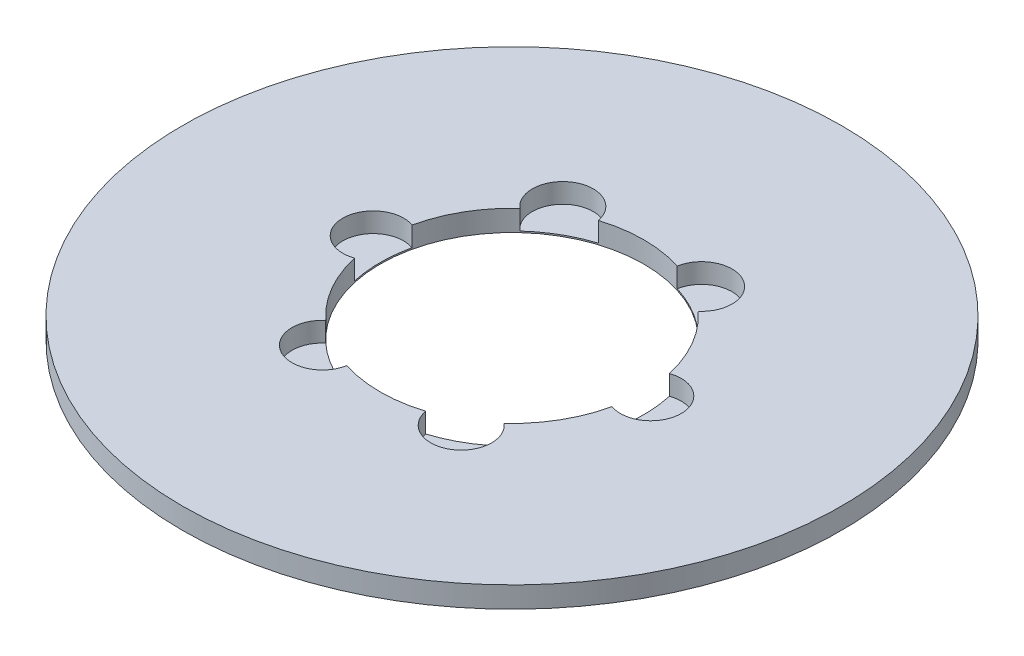
ISO-10303-21;
HEADER;
FILE_DESCRIPTION(('STEP AP214'),'2;1');
FILE_NAME('part.step','',(''),(''),'','','');
FILE_SCHEMA(('AUTOMOTIVE_DESIGN { 1 0 10303 214 1 1 1 1 }'));
ENDSEC;
DATA;
#1=APPLICATION_CONTEXT('core data for automotive mechanical design processes');
#2=APPLICATION_PROTOCOL_DEFINITION('international standard','automotive_design',2000,#1);
#3=PRODUCT_CONTEXT('',#1,'mechanical');
#4=PRODUCT('Part','Part','',(#3));
#5=PRODUCT_RELATED_PRODUCT_CATEGORY('part','',(#4));
#6=PRODUCT_DEFINITION_FORMATION('','',#4);
#7=PRODUCT_DEFINITION_CONTEXT('part definition',#1,'design');
#8=PRODUCT_DEFINITION('design','',#6,#7);
#9=PRODUCT_DEFINITION_SHAPE('','',#8);
#10=(LENGTH_UNIT() NAMED_UNIT(*) SI_UNIT(.MILLI.,.METRE.));
#11=(NAMED_UNIT(*) PLANE_ANGLE_UNIT() SI_UNIT($,.RADIAN.));
#12=(NAMED_UNIT(*) SI_UNIT($,.STERADIAN.) SOLID_ANGLE_UNIT());
#13=UNCERTAINTY_MEASURE_WITH_UNIT(LENGTH_MEASURE(1.E-05),#10,'distance_accuracy_value','');
#14=(GEOMETRIC_REPRESENTATION_CONTEXT(3) GLOBAL_UNCERTAINTY_ASSIGNED_CONTEXT((#13)) GLOBAL_UNIT_ASSIGNED_CONTEXT((#10,
#11,#12)) REPRESENTATION_CONTEXT('',''));
#15=CARTESIAN_POINT('',(0.,0.,0.));
#16=DIRECTION('',(0.,0.,1.));
#17=DIRECTION('',(1.,0.,0.));
#18=AXIS2_PLACEMENT_3D('',#15,#16,#17);
#19=CARTESIAN_POINT('',(0.,4.,0.));
#20=DIRECTION('',(0.,-1.,0.));
#21=DIRECTION('',(0.,0.,-1.));
#22=AXIS2_PLACEMENT_3D('',#19,#20,#21);
#23=CYLINDRICAL_SURFACE('',#22,62.5);
#24=CARTESIAN_POINT('',(0.,4.,0.));
#25=DIRECTION('',(0.,1.,0.));
#26=DIRECTION('',(0.,0.,1.));
#27=AXIS2_PLACEMENT_3D('',#24,#25,#26);
#28=CIRCLE('',#27,62.5);
#29=CARTESIAN_POINT('',(0.,4.,62.5));
#30=VERTEX_POINT('',#29);
#31=EDGE_CURVE('E171',#30,#30,#28,.T.);
#32=ORIENTED_EDGE('',*,*,#31,.F.);
#33=EDGE_LOOP('',(#32));
#34=FACE_BOUND('',#33,.T.);
#35=CARTESIAN_POINT('',(0.,0.,0.));
#36=DIRECTION('',(0.,1.,0.));
#37=DIRECTION('',(0.,0.,1.));
#38=AXIS2_PLACEMENT_3D('',#35,#36,#37);
#39=CIRCLE('',#38,62.5);
#40=CARTESIAN_POINT('',(0.,0.,62.5));
#41=VERTEX_POINT('',#40);
#42=EDGE_CURVE('E157',#41,#41,#39,.T.);
#43=ORIENTED_EDGE('',*,*,#42,.T.);
#44=EDGE_LOOP('',(#43));
#45=FACE_BOUND('',#44,.T.);
#46=ADVANCED_FACE('F39',(#34,#45),#23,.T.);
#47=CARTESIAN_POINT('',(0.,4.,0.));
#48=DIRECTION('',(0.,1.,0.));
#49=DIRECTION('',(0.,0.,1.));
#50=AXIS2_PLACEMENT_3D('',#47,#48,#49);
#51=PLANE('',#50);
#52=CARTESIAN_POINT('',(-13.158900245345,4.,-22.7918837966675));
#53=DIRECTION('',(0.,1.,0.));
#54=DIRECTION('',(-0.866025403784433,0.,0.50000000000001));
#55=AXIS2_PLACEMENT_3D('',#52,#53,#54);
#56=CIRCLE('',#55,5.77557555376692);
#57=CARTESIAN_POINT('',(-7.48185836042713,4.,-23.8541777362899));
#58=VERTEX_POINT('',#57);
#59=CARTESIAN_POINT('',(-16.9173947258031,4.,-18.4065682757914));
#60=VERTEX_POINT('',#59);
#61=EDGE_CURVE('E214',#58,#60,#56,.T.);
#62=ORIENTED_EDGE('',*,*,#61,.F.);
#63=CARTESIAN_POINT('',(0.,4.,0.));
#64=DIRECTION('',(0.,1.,0.));
#65=DIRECTION('',(0.,0.,1.));
#66=AXIS2_PLACEMENT_3D('',#63,#64,#65);
#67=CIRCLE('',#66,25.);
#68=CARTESIAN_POINT('',(7.48185836042663,4.,-23.85417773629));
#69=VERTEX_POINT('',#68);
#70=EDGE_CURVE('E272',#69,#58,#67,.T.);
#71=ORIENTED_EDGE('',*,*,#70,.F.);
#72=CARTESIAN_POINT('',(13.1589002453445,4.,-22.7918837966677));
#73=DIRECTION('',(0.,1.,0.));
#74=DIRECTION('',(-0.866025403784443,0.,-0.499999999999992));
#75=AXIS2_PLACEMENT_3D('',#72,#73,#74);
#76=CIRCLE('',#75,5.77557555376692);
#77=CARTESIAN_POINT('',(16.9173947258027,4.,-18.4065682757918));
#78=VERTEX_POINT('',#77);
#79=EDGE_CURVE('E285',#78,#69,#76,.T.);
#80=ORIENTED_EDGE('',*,*,#79,.F.);
#81=CARTESIAN_POINT('',(24.3992530862297,4.,-5.44760946049833));
#82=VERTEX_POINT('',#81);
#83=EDGE_CURVE('E165',#82,#78,#67,.T.);
#84=ORIENTED_EDGE('',*,*,#83,.F.);
#85=CARTESIAN_POINT('',(26.3178004906894,4.,0.));
#86=DIRECTION('',(0.,1.,0.));
#87=DIRECTION('',(0.,0.,-1.));
#88=AXIS2_PLACEMENT_3D('',#85,#86,#87);
#89=CIRCLE('',#88,5.77557555376692);
#90=CARTESIAN_POINT('',(24.3992530862297,4.,5.44760946049833));
#91=VERTEX_POINT('',#90);
#92=EDGE_CURVE('E281',#91,#82,#89,.T.);
#93=ORIENTED_EDGE('',*,*,#92,.F.);
#94=CARTESIAN_POINT('',(16.9173947258029,4.,18.4065682757915));
#95=VERTEX_POINT('',#94);
#96=EDGE_CURVE('E160',#95,#91,#67,.T.);
#97=ORIENTED_EDGE('',*,*,#96,.F.);
#98=CARTESIAN_POINT('',(13.1589002453448,4.,22.7918837966676));
#99=DIRECTION('',(0.,1.,0.));
#100=DIRECTION('',(0.866025403784436,0.,-0.500000000000004));
#101=AXIS2_PLACEMENT_3D('',#98,#99,#100);
#102=CIRCLE('',#101,5.77557555376692);
#103=CARTESIAN_POINT('',(7.48185836042697,4.,23.8541777362899));
#104=VERTEX_POINT('',#103);
#105=EDGE_CURVE('E154',#104,#95,#102,.T.);
#106=ORIENTED_EDGE('',*,*,#105,.F.);
#107=CARTESIAN_POINT('',(-7.4818583604268,4.,23.85417773629));
#108=VERTEX_POINT('',#107);
#109=EDGE_CURVE('E150',#108,#104,#67,.T.);
#110=ORIENTED_EDGE('',*,*,#109,.F.);
#111=CARTESIAN_POINT('',(-13.1589002453447,4.,22.7918837966676));
#112=DIRECTION('',(0.,1.,0.));
#113=DIRECTION('',(0.86602540378444,0.,0.499999999999998));
#114=AXIS2_PLACEMENT_3D('',#111,#112,#113);
#115=CIRCLE('',#114,5.77557555376692);
#116=CARTESIAN_POINT('',(-16.9173947258028,4.,18.4065682757917));
#117=VERTEX_POINT('',#116);
#118=EDGE_CURVE('E127',#117,#108,#115,.T.);
#119=ORIENTED_EDGE('',*,*,#118,.F.);
#120=CARTESIAN_POINT('',(-24.3992530862297,4.,5.44760946049833));
#121=VERTEX_POINT('',#120);
#122=EDGE_CURVE('E156',#121,#117,#67,.T.);
#123=ORIENTED_EDGE('',*,*,#122,.F.);
#124=CARTESIAN_POINT('',(-26.3178004906894,4.,0.));
#125=DIRECTION('',(0.,1.,0.));
#126=DIRECTION('',(0.,0.,1.));
#127=AXIS2_PLACEMENT_3D('',#124,#125,#126);
#128=CIRCLE('',#127,5.77557555376692);
#129=CARTESIAN_POINT('',(-24.3992530862297,4.,-5.44760946049833));
#130=VERTEX_POINT('',#129);
#131=EDGE_CURVE('E164',#130,#121,#128,.T.);
#132=ORIENTED_EDGE('',*,*,#131,.F.);
#133=EDGE_CURVE('E159',#60,#130,#67,.T.);
#134=ORIENTED_EDGE('',*,*,#133,.F.);
#135=EDGE_LOOP('',(#62,#71,#80,#84,#93,#97,#106,#110,#119,#123,#132,#134));
#136=FACE_BOUND('',#135,.T.);
#137=ORIENTED_EDGE('',*,*,#31,.T.);
#138=EDGE_LOOP('',(#137));
#139=FACE_BOUND('',#138,.T.);
#140=ADVANCED_FACE('F155',(#136,#139),#51,.T.);
#141=CARTESIAN_POINT('',(0.,0.,0.));
#142=DIRECTION('',(0.,1.,0.));
#143=DIRECTION('',(0.,0.,1.));
#144=AXIS2_PLACEMENT_3D('',#141,#142,#143);
#145=PLANE('',#144);
#146=CARTESIAN_POINT('',(0.,0.,0.));
#147=DIRECTION('',(0.,1.,0.));
#148=DIRECTION('',(0.,0.,1.));
#149=AXIS2_PLACEMENT_3D('',#146,#147,#148);
#150=CIRCLE('',#149,25.);
#151=CARTESIAN_POINT('',(0.,0.,25.));
#152=VERTEX_POINT('',#151);
#153=EDGE_CURVE('E170',#152,#152,#150,.T.);
#154=ORIENTED_EDGE('',*,*,#153,.T.);
#155=EDGE_LOOP('',(#154));
#156=FACE_BOUND('',#155,.T.);
#157=ORIENTED_EDGE('',*,*,#42,.F.);
#158=EDGE_LOOP('',(#157));
#159=FACE_BOUND('',#158,.T.);
#160=ADVANCED_FACE('F232',(#156,#159),#145,.F.);
#161=CARTESIAN_POINT('',(0.,4.,0.));
#162=DIRECTION('',(0.,-1.,0.));
#163=DIRECTION('',(0.,0.,-1.));
#164=AXIS2_PLACEMENT_3D('',#161,#162,#163);
#165=CYLINDRICAL_SURFACE('',#164,25.);
#166=DIRECTION('',(0.,1.,0.));
#167=VECTOR('',#166,1.);
#168=CARTESIAN_POINT('',(-7.48185836042713,2.13238522500894,-23.8541777362899));
#169=LINE('',#168,#167);
#170=CARTESIAN_POINT('',(-7.48185836042713,0.264770450017883,-23.8541777362899));
#171=VERTEX_POINT('',#170);
#172=EDGE_CURVE('E11',#171,#58,#169,.T.);
#173=ORIENTED_EDGE('',*,*,#172,.F.);
#174=CARTESIAN_POINT('',(0.,0.264770450017883,0.));
#175=DIRECTION('',(0.,1.,0.));
#176=DIRECTION('',(0.,0.,1.));
#177=AXIS2_PLACEMENT_3D('',#174,#175,#176);
#178=CIRCLE('',#177,25.);
#179=CARTESIAN_POINT('',(-16.9173947258031,0.264770450017883,-18.4065682757914));
#180=VERTEX_POINT('',#179);
#181=EDGE_CURVE('E209',#171,#180,#178,.T.);
#182=ORIENTED_EDGE('',*,*,#181,.T.);
#183=DIRECTION('',(0.,1.,0.));
#184=VECTOR('',#183,1.);
#185=CARTESIAN_POINT('',(-16.9173947258031,2.13238522500894,-18.4065682757914));
#186=LINE('',#185,#184);
#187=EDGE_CURVE('E46',#60,#180,#186,.F.);
#188=ORIENTED_EDGE('',*,*,#187,.F.);
#189=ORIENTED_EDGE('',*,*,#133,.T.);
#190=DIRECTION('',(0.,1.,0.));
#191=VECTOR('',#190,1.);
#192=CARTESIAN_POINT('',(-24.3992530862297,2.13238522500894,-5.44760946049833));
#193=LINE('',#192,#191);
#194=CARTESIAN_POINT('',(-24.3992530862297,0.264770450017883,-5.44760946049833));
#195=VERTEX_POINT('',#194);
#196=EDGE_CURVE('E185',#195,#130,#193,.T.);
#197=ORIENTED_EDGE('',*,*,#196,.F.);
#198=CARTESIAN_POINT('',(0.,0.264770450017883,0.));
#199=DIRECTION('',(0.,1.,0.));
#200=DIRECTION('',(0.,0.,1.));
#201=AXIS2_PLACEMENT_3D('',#198,#199,#200);
#202=CIRCLE('',#201,25.);
#203=CARTESIAN_POINT('',(-24.3992530862297,0.264770450017883,5.44760946049833));
#204=VERTEX_POINT('',#203);
#205=EDGE_CURVE('E173',#195,#204,#202,.T.);
#206=ORIENTED_EDGE('',*,*,#205,.T.);
#207=DIRECTION('',(0.,1.,0.));
#208=VECTOR('',#207,1.);
#209=CARTESIAN_POINT('',(-24.3992530862297,2.13238522500894,5.44760946049833));
#210=LINE('',#209,#208);
#211=EDGE_CURVE('E178',#121,#204,#210,.F.);
#212=ORIENTED_EDGE('',*,*,#211,.F.);
#213=ORIENTED_EDGE('',*,*,#122,.T.);
#214=DIRECTION('',(0.,1.,0.));
#215=VECTOR('',#214,1.);
#216=CARTESIAN_POINT('',(-16.9173947258028,2.13238522500894,18.4065682757917));
#217=LINE('',#216,#215);
#218=CARTESIAN_POINT('',(-16.9173947258028,0.264770450017883,18.4065682757917));
#219=VERTEX_POINT('',#218);
#220=EDGE_CURVE('E132',#219,#117,#217,.T.);
#221=ORIENTED_EDGE('',*,*,#220,.F.);
#222=CARTESIAN_POINT('',(0.,0.264770450017883,0.));
#223=DIRECTION('',(0.,1.,0.));
#224=DIRECTION('',(0.,0.,1.));
#225=AXIS2_PLACEMENT_3D('',#222,#223,#224);
#226=CIRCLE('',#225,25.);
#227=CARTESIAN_POINT('',(-7.4818583604268,0.264770450017883,23.85417773629));
#228=VERTEX_POINT('',#227);
#229=EDGE_CURVE('E146',#219,#228,#226,.T.);
#230=ORIENTED_EDGE('',*,*,#229,.T.);
#231=DIRECTION('',(0.,1.,0.));
#232=VECTOR('',#231,1.);
#233=CARTESIAN_POINT('',(-7.4818583604268,2.13238522500894,23.85417773629));
#234=LINE('',#233,#232);
#235=EDGE_CURVE('E128',#108,#228,#234,.F.);
#236=ORIENTED_EDGE('',*,*,#235,.F.);
#237=ORIENTED_EDGE('',*,*,#109,.T.);
#238=DIRECTION('',(0.,1.,0.));
#239=VECTOR('',#238,1.);
#240=CARTESIAN_POINT('',(7.48185836042697,2.13238522500894,23.8541777362899));
#241=LINE('',#240,#239);
#242=CARTESIAN_POINT('',(7.48185836042697,0.264770450017883,23.8541777362899));
#243=VERTEX_POINT('',#242);
#244=EDGE_CURVE('E192',#243,#104,#241,.T.);
#245=ORIENTED_EDGE('',*,*,#244,.F.);
#246=CARTESIAN_POINT('',(0.,0.264770450017883,0.));
#247=DIRECTION('',(0.,1.,0.));
#248=DIRECTION('',(0.,0.,1.));
#249=AXIS2_PLACEMENT_3D('',#246,#247,#248);
#250=CIRCLE('',#249,25.);
#251=CARTESIAN_POINT('',(16.9173947258029,0.264770450017883,18.4065682757915));
#252=VERTEX_POINT('',#251);
#253=EDGE_CURVE('E190',#243,#252,#250,.T.);
#254=ORIENTED_EDGE('',*,*,#253,.T.);
#255=DIRECTION('',(0.,1.,0.));
#256=VECTOR('',#255,1.);
#257=CARTESIAN_POINT('',(16.9173947258029,2.13238522500894,18.4065682757915));
#258=LINE('',#257,#256);
#259=EDGE_CURVE('E189',#95,#252,#258,.F.);
#260=ORIENTED_EDGE('',*,*,#259,.F.);
#261=ORIENTED_EDGE('',*,*,#96,.T.);
#262=DIRECTION('',(0.,1.,0.));
#263=VECTOR('',#262,1.);
#264=CARTESIAN_POINT('',(24.3992530862297,2.13238522500894,5.44760946049833));
#265=LINE('',#264,#263);
#266=CARTESIAN_POINT('',(24.3992530862297,0.264770450017883,5.44760946049833));
#267=VERTEX_POINT('',#266);
#268=EDGE_CURVE('E203',#267,#91,#265,.T.);
#269=ORIENTED_EDGE('',*,*,#268,.F.);
#270=CARTESIAN_POINT('',(0.,0.264770450017883,0.));
#271=DIRECTION('',(0.,1.,0.));
#272=DIRECTION('',(0.,0.,1.));
#273=AXIS2_PLACEMENT_3D('',#270,#271,#272);
#274=CIRCLE('',#273,25.);
#275=CARTESIAN_POINT('',(24.3992530862297,0.264770450017883,-5.44760946049833));
#276=VERTEX_POINT('',#275);
#277=EDGE_CURVE('E194',#267,#276,#274,.T.);
#278=ORIENTED_EDGE('',*,*,#277,.T.);
#279=DIRECTION('',(0.,1.,0.));
#280=VECTOR('',#279,1.);
#281=CARTESIAN_POINT('',(24.3992530862297,2.13238522500894,-5.44760946049833));
#282=LINE('',#281,#280);
#283=EDGE_CURVE('E196',#82,#276,#282,.F.);
#284=ORIENTED_EDGE('',*,*,#283,.F.);
#285=ORIENTED_EDGE('',*,*,#83,.T.);
#286=DIRECTION('',(0.,1.,0.));
#287=VECTOR('',#286,1.);
#288=CARTESIAN_POINT('',(16.9173947258027,2.13238522500894,-18.4065682757918));
#289=LINE('',#288,#287);
#290=CARTESIAN_POINT('',(16.9173947258027,0.264770450017883,-18.4065682757918));
#291=VERTEX_POINT('',#290);
#292=EDGE_CURVE('E208',#291,#78,#289,.T.);
#293=ORIENTED_EDGE('',*,*,#292,.F.);
#294=CARTESIAN_POINT('',(0.,0.264770450017883,0.));
#295=DIRECTION('',(0.,1.,0.));
#296=DIRECTION('',(0.,0.,1.));
#297=AXIS2_PLACEMENT_3D('',#294,#295,#296);
#298=CIRCLE('',#297,25.);
#299=CARTESIAN_POINT('',(7.48185836042663,0.264770450017883,-23.85417773629));
#300=VERTEX_POINT('',#299);
#301=EDGE_CURVE('E201',#291,#300,#298,.T.);
#302=ORIENTED_EDGE('',*,*,#301,.T.);
#303=DIRECTION('',(0.,1.,0.));
#304=VECTOR('',#303,1.);
#305=CARTESIAN_POINT('',(7.48185836042664,2.13238522500894,-23.85417773629));
#306=LINE('',#305,#304);
#307=EDGE_CURVE('E206',#69,#300,#306,.F.);
#308=ORIENTED_EDGE('',*,*,#307,.F.);
#309=ORIENTED_EDGE('',*,*,#70,.T.);
#310=EDGE_LOOP('',(#173,#182,#188,#189,#197,#206,#212,#213,#221,#230,#236,#237,#245,#254,#260,
#261,#269,#278,#284,#285,#293,#302,#308,#309));
#311=FACE_BOUND('',#310,.T.);
#312=ORIENTED_EDGE('',*,*,#153,.F.);
#313=EDGE_LOOP('',(#312));
#314=FACE_BOUND('',#313,.T.);
#315=ADVANCED_FACE('F145',(#311,#314),#165,.F.);
#316=CARTESIAN_POINT('',(-26.3178004906894,0.264770450017883,0.));
#317=DIRECTION('',(0.,1.,0.));
#318=DIRECTION('',(0.,0.,1.));
#319=AXIS2_PLACEMENT_3D('',#316,#317,#318);
#320=CYLINDRICAL_SURFACE('',#319,5.77557555376692);
#321=ORIENTED_EDGE('',*,*,#196,.T.);
#322=ORIENTED_EDGE('',*,*,#131,.T.);
#323=ORIENTED_EDGE('',*,*,#211,.T.);
#324=CARTESIAN_POINT('',(-26.3178004906894,0.264770450017883,0.));
#325=DIRECTION('',(0.,1.,0.));
#326=DIRECTION('',(0.,0.,1.));
#327=AXIS2_PLACEMENT_3D('',#324,#325,#326);
#328=CIRCLE('',#327,5.77557555376692);
#329=EDGE_CURVE('E168',#195,#204,#328,.T.);
#330=ORIENTED_EDGE('',*,*,#329,.F.);
#331=EDGE_LOOP('',(#321,#322,#323,#330));
#332=FACE_BOUND('',#331,.T.);
#333=ADVANCED_FACE('F243',(#332),#320,.F.);
#334=CARTESIAN_POINT('',(-26.3178004906894,0.264770450017883,0.));
#335=DIRECTION('',(0.,1.,0.));
#336=DIRECTION('',(0.,0.,1.));
#337=AXIS2_PLACEMENT_3D('',#334,#335,#336);
#338=PLANE('',#337);
#339=ORIENTED_EDGE('',*,*,#329,.T.);
#340=ORIENTED_EDGE('',*,*,#205,.F.);
#341=EDGE_LOOP('',(#339,#340));
#342=FACE_BOUND('',#341,.T.);
#343=ADVANCED_FACE('F247',(#342),#338,.T.);
#344=CARTESIAN_POINT('',(-13.1589002453447,0.264770450017883,22.7918837966676));
#345=DIRECTION('',(0.,1.,0.));
#346=DIRECTION('',(0.,0.,1.));
#347=AXIS2_PLACEMENT_3D('',#344,#345,#346);
#348=CYLINDRICAL_SURFACE('',#347,5.77557555376692);
#349=ORIENTED_EDGE('',*,*,#220,.T.);
#350=ORIENTED_EDGE('',*,*,#118,.T.);
#351=ORIENTED_EDGE('',*,*,#235,.T.);
#352=CARTESIAN_POINT('',(-13.1589002453447,0.264770450017883,22.7918837966676));
#353=DIRECTION('',(0.,1.,0.));
#354=DIRECTION('',(0.86602540378444,0.,0.499999999999998));
#355=AXIS2_PLACEMENT_3D('',#352,#353,#354);
#356=CIRCLE('',#355,5.77557555376692);
#357=EDGE_CURVE('E137',#219,#228,#356,.T.);
#358=ORIENTED_EDGE('',*,*,#357,.F.);
#359=EDGE_LOOP('',(#349,#350,#351,#358));
#360=FACE_BOUND('',#359,.T.);
#361=ADVANCED_FACE('F126',(#360),#348,.F.);
#362=CARTESIAN_POINT('',(-13.1589002453447,0.264770450017883,22.7918837966676));
#363=DIRECTION('',(0.,1.,0.));
#364=DIRECTION('',(0.86602540378444,0.,0.499999999999998));
#365=AXIS2_PLACEMENT_3D('',#362,#363,#364);
#366=PLANE('',#365);
#367=ORIENTED_EDGE('',*,*,#357,.T.);
#368=ORIENTED_EDGE('',*,*,#229,.F.);
#369=EDGE_LOOP('',(#367,#368));
#370=FACE_BOUND('',#369,.T.);
#371=ADVANCED_FACE('F254',(#370),#366,.T.);
#372=CARTESIAN_POINT('',(13.1589002453448,0.264770450017883,22.7918837966676));
#373=DIRECTION('',(0.,1.,0.));
#374=DIRECTION('',(0.,0.,1.));
#375=AXIS2_PLACEMENT_3D('',#372,#373,#374);
#376=CYLINDRICAL_SURFACE('',#375,5.77557555376692);
#377=ORIENTED_EDGE('',*,*,#244,.T.);
#378=ORIENTED_EDGE('',*,*,#105,.T.);
#379=ORIENTED_EDGE('',*,*,#259,.T.);
#380=CARTESIAN_POINT('',(13.1589002453448,0.264770450017883,22.7918837966676));
#381=DIRECTION('',(0.,1.,0.));
#382=DIRECTION('',(0.866025403784436,0.,-0.500000000000004));
#383=AXIS2_PLACEMENT_3D('',#380,#381,#382);
#384=CIRCLE('',#383,5.77557555376692);
#385=EDGE_CURVE('E138',#243,#252,#384,.T.);
#386=ORIENTED_EDGE('',*,*,#385,.F.);
#387=EDGE_LOOP('',(#377,#378,#379,#386));
#388=FACE_BOUND('',#387,.T.);
#389=ADVANCED_FACE('F260',(#388),#376,.F.);
#390=CARTESIAN_POINT('',(13.1589002453448,0.264770450017883,22.7918837966676));
#391=DIRECTION('',(0.,1.,0.));
#392=DIRECTION('',(0.866025403784436,0.,-0.500000000000004));
#393=AXIS2_PLACEMENT_3D('',#390,#391,#392);
#394=PLANE('',#393);
#395=ORIENTED_EDGE('',*,*,#385,.T.);
#396=ORIENTED_EDGE('',*,*,#253,.F.);
#397=EDGE_LOOP('',(#395,#396));
#398=FACE_BOUND('',#397,.T.);
#399=ADVANCED_FACE('F265',(#398),#394,.T.);
#400=CARTESIAN_POINT('',(26.3178004906894,0.264770450017883,0.));
#401=DIRECTION('',(0.,1.,0.));
#402=DIRECTION('',(0.,0.,1.));
#403=AXIS2_PLACEMENT_3D('',#400,#401,#402);
#404=CYLINDRICAL_SURFACE('',#403,5.77557555376692);
#405=ORIENTED_EDGE('',*,*,#268,.T.);
#406=ORIENTED_EDGE('',*,*,#92,.T.);
#407=ORIENTED_EDGE('',*,*,#283,.T.);
#408=CARTESIAN_POINT('',(26.3178004906894,0.264770450017883,0.));
#409=DIRECTION('',(0.,1.,0.));
#410=DIRECTION('',(0.,0.,-1.));
#411=AXIS2_PLACEMENT_3D('',#408,#409,#410);
#412=CIRCLE('',#411,5.77557555376692);
#413=EDGE_CURVE('E287',#267,#276,#412,.T.);
#414=ORIENTED_EDGE('',*,*,#413,.F.);
#415=EDGE_LOOP('',(#405,#406,#407,#414));
#416=FACE_BOUND('',#415,.T.);
#417=ADVANCED_FACE('F300',(#416),#404,.F.);
#418=CARTESIAN_POINT('',(26.3178004906894,0.264770450017883,0.));
#419=DIRECTION('',(0.,1.,0.));
#420=DIRECTION('',(0.,0.,-1.));
#421=AXIS2_PLACEMENT_3D('',#418,#419,#420);
#422=PLANE('',#421);
#423=ORIENTED_EDGE('',*,*,#413,.T.);
#424=ORIENTED_EDGE('',*,*,#277,.F.);
#425=EDGE_LOOP('',(#423,#424));
#426=FACE_BOUND('',#425,.T.);
#427=ADVANCED_FACE('F298',(#426),#422,.T.);
#428=CARTESIAN_POINT('',(13.1589002453445,0.264770450017883,-22.7918837966677));
#429=DIRECTION('',(0.,1.,0.));
#430=DIRECTION('',(0.,0.,1.));
#431=AXIS2_PLACEMENT_3D('',#428,#429,#430);
#432=CYLINDRICAL_SURFACE('',#431,5.77557555376692);
#433=ORIENTED_EDGE('',*,*,#292,.T.);
#434=ORIENTED_EDGE('',*,*,#79,.T.);
#435=ORIENTED_EDGE('',*,*,#307,.T.);
#436=CARTESIAN_POINT('',(13.1589002453445,0.264770450017883,-22.7918837966677));
#437=DIRECTION('',(0.,1.,0.));
#438=DIRECTION('',(-0.866025403784443,0.,-0.499999999999992));
#439=AXIS2_PLACEMENT_3D('',#436,#437,#438);
#440=CIRCLE('',#439,5.77557555376692);
#441=EDGE_CURVE('E56',#291,#300,#440,.T.);
#442=ORIENTED_EDGE('',*,*,#441,.F.);
#443=EDGE_LOOP('',(#433,#434,#435,#442));
#444=FACE_BOUND('',#443,.T.);
#445=ADVANCED_FACE('F301',(#444),#432,.F.);
#446=CARTESIAN_POINT('',(13.1589002453445,0.264770450017883,-22.7918837966677));
#447=DIRECTION('',(0.,1.,0.));
#448=DIRECTION('',(-0.866025403784443,0.,-0.499999999999992));
#449=AXIS2_PLACEMENT_3D('',#446,#447,#448);
#450=PLANE('',#449);
#451=ORIENTED_EDGE('',*,*,#441,.T.);
#452=ORIENTED_EDGE('',*,*,#301,.F.);
#453=EDGE_LOOP('',(#451,#452));
#454=FACE_BOUND('',#453,.T.);
#455=ADVANCED_FACE('F221',(#454),#450,.T.);
#456=CARTESIAN_POINT('',(-13.158900245345,0.264770450017883,-22.7918837966675));
#457=DIRECTION('',(0.,1.,0.));
#458=DIRECTION('',(0.,0.,1.));
#459=AXIS2_PLACEMENT_3D('',#456,#457,#458);
#460=CYLINDRICAL_SURFACE('',#459,5.77557555376692);
#461=ORIENTED_EDGE('',*,*,#172,.T.);
#462=ORIENTED_EDGE('',*,*,#61,.T.);
#463=ORIENTED_EDGE('',*,*,#187,.T.);
#464=CARTESIAN_POINT('',(-13.158900245345,0.264770450017883,-22.7918837966675));
#465=DIRECTION('',(0.,1.,0.));
#466=DIRECTION('',(-0.866025403784433,0.,0.50000000000001));
#467=AXIS2_PLACEMENT_3D('',#464,#465,#466);
#468=CIRCLE('',#467,5.77557555376692);
#469=EDGE_CURVE('E55',#171,#180,#468,.T.);
#470=ORIENTED_EDGE('',*,*,#469,.F.);
#471=EDGE_LOOP('',(#461,#462,#463,#470));
#472=FACE_BOUND('',#471,.T.);
#473=ADVANCED_FACE('F212',(#472),#460,.F.);
#474=CARTESIAN_POINT('',(-13.158900245345,0.264770450017883,-22.7918837966675));
#475=DIRECTION('',(0.,1.,0.));
#476=DIRECTION('',(-0.866025403784433,0.,0.50000000000001));
#477=AXIS2_PLACEMENT_3D('',#474,#475,#476);
#478=PLANE('',#477);
#479=ORIENTED_EDGE('',*,*,#469,.T.);
#480=ORIENTED_EDGE('',*,*,#181,.F.);
#481=EDGE_LOOP('',(#479,#480));
#482=FACE_BOUND('',#481,.T.);
#483=ADVANCED_FACE('F217',(#482),#478,.T.);
#484=CLOSED_SHELL('',(#46,#140,#160,#315,#333,#343,#361,#371,#389,#399,#417,#427,#445,#455,#473,#483));
#485=MANIFOLD_SOLID_BREP('B2',#484);
#486=ADVANCED_BREP_SHAPE_REPRESENTATION('',(#18,#485),#14);
#487=SHAPE_DEFINITION_REPRESENTATION(#9,#486);
ENDSEC;
END-ISO-10303-21;
